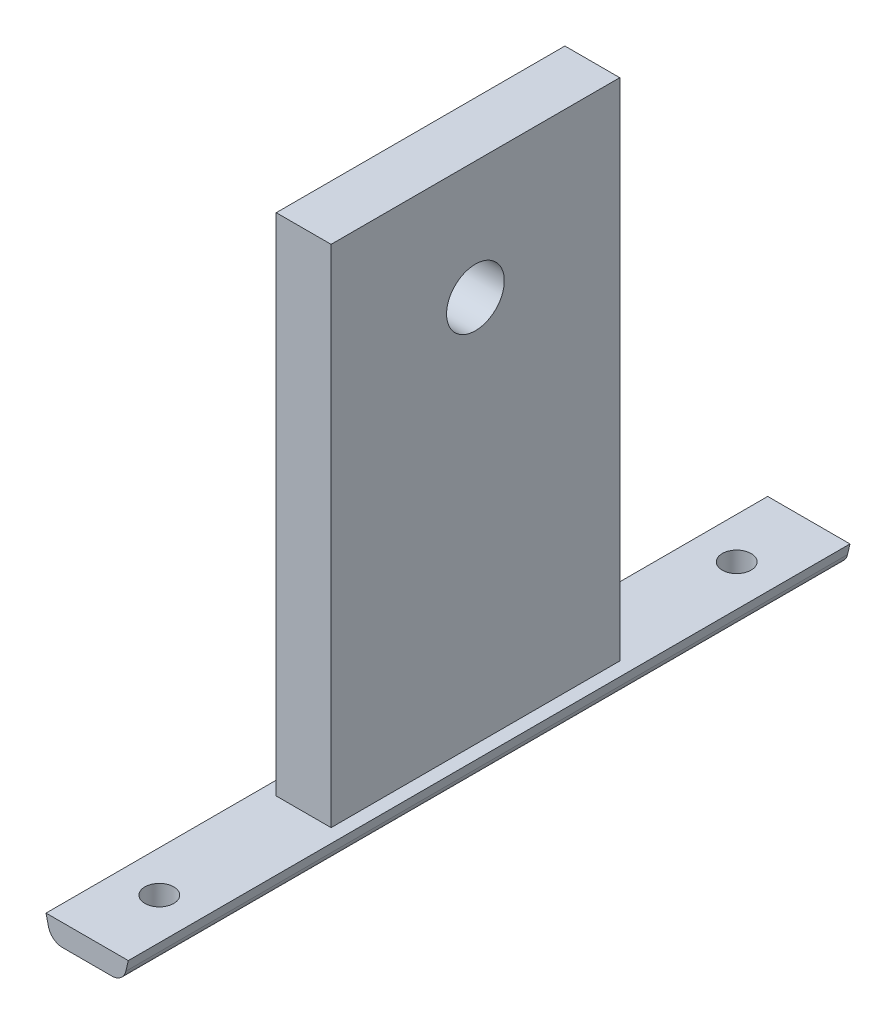
ISO-10303-21;
HEADER;
FILE_DESCRIPTION(('STEP AP214'),'2;1');
FILE_NAME('part.step','',(''),(''),'','','');
FILE_SCHEMA(('AUTOMOTIVE_DESIGN { 1 0 10303 214 1 1 1 1 }'));
ENDSEC;
DATA;
#1=APPLICATION_CONTEXT('core data for automotive mechanical design processes');
#2=APPLICATION_PROTOCOL_DEFINITION('international standard','automotive_design',2000,#1);
#3=PRODUCT_CONTEXT('',#1,'mechanical');
#4=PRODUCT('Part','Part','',(#3));
#5=PRODUCT_RELATED_PRODUCT_CATEGORY('part','',(#4));
#6=PRODUCT_DEFINITION_FORMATION('','',#4);
#7=PRODUCT_DEFINITION_CONTEXT('part definition',#1,'design');
#8=PRODUCT_DEFINITION('design','',#6,#7);
#9=PRODUCT_DEFINITION_SHAPE('','',#8);
#10=(LENGTH_UNIT() NAMED_UNIT(*) SI_UNIT(.MILLI.,.METRE.));
#11=(NAMED_UNIT(*) PLANE_ANGLE_UNIT() SI_UNIT($,.RADIAN.));
#12=(NAMED_UNIT(*) SI_UNIT($,.STERADIAN.) SOLID_ANGLE_UNIT());
#13=UNCERTAINTY_MEASURE_WITH_UNIT(LENGTH_MEASURE(1.E-05),#10,'distance_accuracy_value','');
#14=(GEOMETRIC_REPRESENTATION_CONTEXT(3) GLOBAL_UNCERTAINTY_ASSIGNED_CONTEXT((#13)) GLOBAL_UNIT_ASSIGNED_CONTEXT((#10,
#11,#12)) REPRESENTATION_CONTEXT('',''));
#15=CARTESIAN_POINT('',(0.,0.,0.));
#16=DIRECTION('',(0.,0.,1.));
#17=DIRECTION('',(1.,0.,0.));
#18=AXIS2_PLACEMENT_3D('',#15,#16,#17);
#19=CARTESIAN_POINT('',(3.8,-48.1786246589821,100.));
#20=DIRECTION('',(-1.,0.,0.));
#21=DIRECTION('',(0.,0.,1.));
#22=AXIS2_PLACEMENT_3D('',#19,#20,#21);
#23=PLANE('',#22);
#24=DIRECTION('',(0.,0.,-1.));
#25=VECTOR('',#24,1.);
#26=CARTESIAN_POINT('',(3.8,21.821375341018,100.));
#27=LINE('',#26,#25);
#28=CARTESIAN_POINT('',(3.8,21.821375341018,70.));
#29=VERTEX_POINT('',#28);
#30=CARTESIAN_POINT('',(3.8,21.821375341018,30.));
#31=VERTEX_POINT('',#30);
#32=EDGE_CURVE('E45',#29,#31,#27,.T.);
#33=ORIENTED_EDGE('',*,*,#32,.F.);
#34=DIRECTION('',(0.,-1.,0.));
#35=VECTOR('',#34,1.);
#36=CARTESIAN_POINT('',(3.8,21.821375341018,70.));
#37=LINE('',#36,#35);
#38=CARTESIAN_POINT('',(3.8,-48.1786246589821,70.));
#39=VERTEX_POINT('',#38);
#40=EDGE_CURVE('E190',#29,#39,#37,.T.);
#41=ORIENTED_EDGE('',*,*,#40,.T.);
#42=DIRECTION('',(0.,0.,-1.));
#43=VECTOR('',#42,1.);
#44=CARTESIAN_POINT('',(3.8,-48.1786246589821,100.));
#45=LINE('',#44,#43);
#46=CARTESIAN_POINT('',(3.8,-48.1786246589821,30.));
#47=VERTEX_POINT('',#46);
#48=EDGE_CURVE('E12',#39,#47,#45,.T.);
#49=ORIENTED_EDGE('',*,*,#48,.T.);
#50=DIRECTION('',(0.,1.,0.));
#51=VECTOR('',#50,1.);
#52=CARTESIAN_POINT('',(3.8,-48.1786246589821,30.));
#53=LINE('',#52,#51);
#54=EDGE_CURVE('E213',#47,#31,#53,.T.);
#55=ORIENTED_EDGE('',*,*,#54,.T.);
#56=EDGE_LOOP('',(#33,#41,#49,#55));
#57=FACE_BOUND('',#56,.T.);
#58=CARTESIAN_POINT('',(3.8,5.45168836956956,50.));
#59=DIRECTION('',(1.,0.,0.));
#60=DIRECTION('',(0.,0.,-1.));
#61=AXIS2_PLACEMENT_3D('',#58,#59,#60);
#62=CIRCLE('',#61,4.);
#63=CARTESIAN_POINT('',(3.8,5.45168836956956,54.));
#64=VERTEX_POINT('',#63);
#65=EDGE_CURVE('E177',#64,#64,#62,.T.);
#66=ORIENTED_EDGE('',*,*,#65,.F.);
#67=EDGE_LOOP('',(#66));
#68=FACE_BOUND('',#67,.T.);
#69=ADVANCED_FACE('F36',(#57,#68),#23,.F.);
#70=CARTESIAN_POINT('',(-3.8,-48.1786246589821,100.));
#71=DIRECTION('',(1.,0.,0.));
#72=DIRECTION('',(0.,0.,-1.));
#73=AXIS2_PLACEMENT_3D('',#70,#71,#72);
#74=PLANE('',#73);
#75=DIRECTION('',(0.,0.,-1.));
#76=VECTOR('',#75,1.);
#77=CARTESIAN_POINT('',(-3.8,-48.1786246589821,100.));
#78=LINE('',#77,#76);
#79=CARTESIAN_POINT('',(-3.8,-48.1786246589821,70.));
#80=VERTEX_POINT('',#79);
#81=CARTESIAN_POINT('',(-3.8,-48.1786246589821,30.));
#82=VERTEX_POINT('',#81);
#83=EDGE_CURVE('E146',#80,#82,#78,.T.);
#84=ORIENTED_EDGE('',*,*,#83,.F.);
#85=DIRECTION('',(0.,1.,0.));
#86=VECTOR('',#85,1.);
#87=CARTESIAN_POINT('',(-3.8,-48.1786246589821,70.));
#88=LINE('',#87,#86);
#89=CARTESIAN_POINT('',(-3.8,21.821375341018,70.));
#90=VERTEX_POINT('',#89);
#91=EDGE_CURVE('E193',#80,#90,#88,.T.);
#92=ORIENTED_EDGE('',*,*,#91,.T.);
#93=DIRECTION('',(0.,0.,-1.));
#94=VECTOR('',#93,1.);
#95=CARTESIAN_POINT('',(-3.8,21.821375341018,100.));
#96=LINE('',#95,#94);
#97=CARTESIAN_POINT('',(-3.8,21.821375341018,30.));
#98=VERTEX_POINT('',#97);
#99=EDGE_CURVE('E154',#90,#98,#96,.T.);
#100=ORIENTED_EDGE('',*,*,#99,.T.);
#101=DIRECTION('',(0.,-1.,0.));
#102=VECTOR('',#101,1.);
#103=CARTESIAN_POINT('',(-3.8,-48.1786246589821,30.));
#104=LINE('',#103,#102);
#105=EDGE_CURVE('E196',#98,#82,#104,.T.);
#106=ORIENTED_EDGE('',*,*,#105,.T.);
#107=EDGE_LOOP('',(#84,#92,#100,#106));
#108=FACE_BOUND('',#107,.T.);
#109=CARTESIAN_POINT('',(-3.8,5.45168836956956,50.));
#110=DIRECTION('',(1.,0.,0.));
#111=DIRECTION('',(0.,0.,-1.));
#112=AXIS2_PLACEMENT_3D('',#109,#110,#111);
#113=CIRCLE('',#112,4.);
#114=CARTESIAN_POINT('',(-3.8,5.45168836956956,54.));
#115=VERTEX_POINT('',#114);
#116=EDGE_CURVE('E39',#115,#115,#113,.F.);
#117=ORIENTED_EDGE('',*,*,#116,.F.);
#118=EDGE_LOOP('',(#117));
#119=FACE_BOUND('',#118,.T.);
#120=ADVANCED_FACE('F232',(#108,#119),#74,.F.);
#121=CARTESIAN_POINT('',(-3.8,-48.1786246589821,100.));
#122=DIRECTION('',(0.,-1.,0.));
#123=DIRECTION('',(0.,0.,-1.));
#124=AXIS2_PLACEMENT_3D('',#121,#122,#123);
#125=PLANE('',#124);
#126=CARTESIAN_POINT('',(0.,-48.1786246589821,10.));
#127=DIRECTION('',(0.,-1.,0.));
#128=DIRECTION('',(0.,0.,-1.));
#129=AXIS2_PLACEMENT_3D('',#126,#127,#128);
#130=CIRCLE('',#129,2.);
#131=CARTESIAN_POINT('',(0.,-48.1786246589821,8.));
#132=VERTEX_POINT('',#131);
#133=EDGE_CURVE('E168',#132,#132,#130,.F.);
#134=ORIENTED_EDGE('',*,*,#133,.F.);
#135=EDGE_LOOP('',(#134));
#136=FACE_BOUND('',#135,.T.);
#137=ORIENTED_EDGE('',*,*,#48,.F.);
#138=DIRECTION('',(-1.,0.,0.));
#139=VECTOR('',#138,1.);
#140=CARTESIAN_POINT('',(3.8,-48.1786246589821,70.));
#141=LINE('',#140,#139);
#142=EDGE_CURVE('E187',#39,#80,#141,.T.);
#143=ORIENTED_EDGE('',*,*,#142,.T.);
#144=ORIENTED_EDGE('',*,*,#83,.T.);
#145=DIRECTION('',(1.,0.,0.));
#146=VECTOR('',#145,1.);
#147=CARTESIAN_POINT('',(-3.8,-48.1786246589821,30.));
#148=LINE('',#147,#146);
#149=EDGE_CURVE('E210',#82,#47,#148,.T.);
#150=ORIENTED_EDGE('',*,*,#149,.T.);
#151=EDGE_LOOP('',(#137,#143,#144,#150));
#152=FACE_BOUND('',#151,.T.);
#153=DIRECTION('',(-1.,0.,0.));
#154=VECTOR('',#153,1.);
#155=CARTESIAN_POINT('',(-3.8,-48.1786246589821,0.));
#156=LINE('',#155,#154);
#157=CARTESIAN_POINT('',(5.70000000000001,-48.1786246589821,0.));
#158=VERTEX_POINT('',#157);
#159=CARTESIAN_POINT('',(-5.69999999999999,-48.1786246589821,0.));
#160=VERTEX_POINT('',#159);
#161=EDGE_CURVE('E85',#158,#160,#156,.T.);
#162=ORIENTED_EDGE('',*,*,#161,.T.);
#163=DIRECTION('',(0.,0.,-1.));
#164=VECTOR('',#163,1.);
#165=CARTESIAN_POINT('',(-5.69999999999999,-48.1786246589821,100.));
#166=LINE('',#165,#164);
#167=CARTESIAN_POINT('',(-5.69999999999999,-48.1786246589821,100.));
#168=VERTEX_POINT('',#167);
#169=EDGE_CURVE('E143',#168,#160,#166,.T.);
#170=ORIENTED_EDGE('',*,*,#169,.F.);
#171=DIRECTION('',(-1.,0.,0.));
#172=VECTOR('',#171,1.);
#173=CARTESIAN_POINT('',(3.8,-48.1786246589821,100.));
#174=LINE('',#173,#172);
#175=CARTESIAN_POINT('',(5.70000000000001,-48.1786246589821,100.));
#176=VERTEX_POINT('',#175);
#177=EDGE_CURVE('E91',#176,#168,#174,.T.);
#178=ORIENTED_EDGE('',*,*,#177,.F.);
#179=DIRECTION('',(0.,0.,-1.));
#180=VECTOR('',#179,1.);
#181=CARTESIAN_POINT('',(5.70000000000001,-48.1786246589821,100.));
#182=LINE('',#181,#180);
#183=EDGE_CURVE('E122',#176,#158,#182,.T.);
#184=ORIENTED_EDGE('',*,*,#183,.T.);
#185=EDGE_LOOP('',(#162,#170,#178,#184));
#186=FACE_BOUND('',#185,.T.);
#187=CARTESIAN_POINT('',(0.,-48.1786246589821,90.));
#188=DIRECTION('',(0.,-1.,0.));
#189=DIRECTION('',(0.,0.,-1.));
#190=AXIS2_PLACEMENT_3D('',#187,#188,#189);
#191=CIRCLE('',#190,2.);
#192=CARTESIAN_POINT('',(0.,-48.1786246589821,88.));
#193=VERTEX_POINT('',#192);
#194=EDGE_CURVE('E169',#193,#193,#191,.F.);
#195=ORIENTED_EDGE('',*,*,#194,.F.);
#196=EDGE_LOOP('',(#195));
#197=FACE_BOUND('',#196,.T.);
#198=ADVANCED_FACE('F229',(#136,#152,#186,#197),#125,.F.);
#199=CARTESIAN_POINT('',(-3.41294375990008,-51.1786246589821,100.));
#200=DIRECTION('',(0.,1.,0.));
#201=DIRECTION('',(0.,0.,1.));
#202=AXIS2_PLACEMENT_3D('',#199,#200,#201);
#203=PLANE('',#202);
#204=CARTESIAN_POINT('',(0.,-51.1786246589821,10.));
#205=DIRECTION('',(0.,1.,0.));
#206=DIRECTION('',(0.,0.,1.));
#207=AXIS2_PLACEMENT_3D('',#204,#205,#206);
#208=CIRCLE('',#207,2.);
#209=CARTESIAN_POINT('',(0.,-51.1786246589821,12.));
#210=VERTEX_POINT('',#209);
#211=EDGE_CURVE('E166',#210,#210,#208,.F.);
#212=ORIENTED_EDGE('',*,*,#211,.F.);
#213=EDGE_LOOP('',(#212));
#214=FACE_BOUND('',#213,.T.);
#215=DIRECTION('',(1.,0.,0.));
#216=VECTOR('',#215,1.);
#217=CARTESIAN_POINT('',(-3.41294375990008,-51.1786246589821,0.));
#218=LINE('',#217,#216);
#219=CARTESIAN_POINT('',(-3.41294375990008,-51.1786246589821,0.));
#220=VERTEX_POINT('',#219);
#221=CARTESIAN_POINT('',(3.4129437599001,-51.1786246589821,0.));
#222=VERTEX_POINT('',#221);
#223=EDGE_CURVE('E116',#220,#222,#218,.T.);
#224=ORIENTED_EDGE('',*,*,#223,.T.);
#225=DIRECTION('',(0.,0.,-1.));
#226=VECTOR('',#225,1.);
#227=CARTESIAN_POINT('',(3.4129437599001,-51.1786246589821,100.));
#228=LINE('',#227,#226);
#229=CARTESIAN_POINT('',(3.4129437599001,-51.1786246589821,100.));
#230=VERTEX_POINT('',#229);
#231=EDGE_CURVE('E112',#230,#222,#228,.T.);
#232=ORIENTED_EDGE('',*,*,#231,.F.);
#233=DIRECTION('',(1.,0.,0.));
#234=VECTOR('',#233,1.);
#235=CARTESIAN_POINT('',(-3.41294375990008,-51.1786246589821,100.));
#236=LINE('',#235,#234);
#237=CARTESIAN_POINT('',(-3.41294375990008,-51.1786246589821,100.));
#238=VERTEX_POINT('',#237);
#239=EDGE_CURVE('E101',#238,#230,#236,.T.);
#240=ORIENTED_EDGE('',*,*,#239,.F.);
#241=DIRECTION('',(0.,0.,-1.));
#242=VECTOR('',#241,1.);
#243=CARTESIAN_POINT('',(-3.41294375990008,-51.1786246589821,100.));
#244=LINE('',#243,#242);
#245=EDGE_CURVE('E117',#238,#220,#244,.T.);
#246=ORIENTED_EDGE('',*,*,#245,.T.);
#247=EDGE_LOOP('',(#224,#232,#240,#246));
#248=FACE_BOUND('',#247,.T.);
#249=CARTESIAN_POINT('',(0.,-51.1786246589821,90.));
#250=DIRECTION('',(0.,1.,0.));
#251=DIRECTION('',(0.,0.,1.));
#252=AXIS2_PLACEMENT_3D('',#249,#250,#251);
#253=CIRCLE('',#252,2.);
#254=CARTESIAN_POINT('',(0.,-51.1786246589821,92.));
#255=VERTEX_POINT('',#254);
#256=EDGE_CURVE('E170',#255,#255,#253,.F.);
#257=ORIENTED_EDGE('',*,*,#256,.F.);
#258=EDGE_LOOP('',(#257));
#259=FACE_BOUND('',#258,.T.);
#260=ADVANCED_FACE('F113',(#214,#248,#259),#203,.F.);
#261=CARTESIAN_POINT('',(3.8,21.821375341018,100.));
#262=DIRECTION('',(0.,-1.,0.));
#263=DIRECTION('',(0.,0.,-1.));
#264=AXIS2_PLACEMENT_3D('',#261,#262,#263);
#265=PLANE('',#264);
#266=ORIENTED_EDGE('',*,*,#99,.F.);
#267=DIRECTION('',(1.,0.,0.));
#268=VECTOR('',#267,1.);
#269=CARTESIAN_POINT('',(-3.8,21.821375341018,70.));
#270=LINE('',#269,#268);
#271=EDGE_CURVE('E197',#90,#29,#270,.T.);
#272=ORIENTED_EDGE('',*,*,#271,.T.);
#273=ORIENTED_EDGE('',*,*,#32,.T.);
#274=DIRECTION('',(-1.,0.,0.));
#275=VECTOR('',#274,1.);
#276=CARTESIAN_POINT('',(-3.8,21.821375341018,30.));
#277=LINE('',#276,#275);
#278=EDGE_CURVE('E128',#31,#98,#277,.T.);
#279=ORIENTED_EDGE('',*,*,#278,.T.);
#280=EDGE_LOOP('',(#266,#272,#273,#279));
#281=FACE_BOUND('',#280,.T.);
#282=ADVANCED_FACE('F270',(#281),#265,.F.);
#283=CARTESIAN_POINT('',(-5.36062617938366,-49.6330838901949,100.));
#284=DIRECTION('',(0.973841209741793,0.227229615606418,0.));
#285=DIRECTION('',(-0.227229615606418,0.973841209741793,0.));
#286=AXIS2_PLACEMENT_3D('',#283,#284,#285);
#287=PLANE('',#286);
#288=DIRECTION('',(0.227229615606418,-0.973841209741793,0.));
#289=VECTOR('',#288,1.);
#290=CARTESIAN_POINT('',(-5.36062617938366,-49.6330838901949,0.));
#291=LINE('',#290,#289);
#292=CARTESIAN_POINT('',(-5.36062617938366,-49.6330838901949,0.));
#293=VERTEX_POINT('',#292);
#294=EDGE_CURVE('E127',#160,#293,#291,.T.);
#295=ORIENTED_EDGE('',*,*,#294,.T.);
#296=DIRECTION('',(0.,0.,-1.));
#297=VECTOR('',#296,1.);
#298=CARTESIAN_POINT('',(-5.36062617938366,-49.6330838901949,100.));
#299=LINE('',#298,#297);
#300=CARTESIAN_POINT('',(-5.36062617938366,-49.6330838901949,100.));
#301=VERTEX_POINT('',#300);
#302=EDGE_CURVE('E140',#301,#293,#299,.T.);
#303=ORIENTED_EDGE('',*,*,#302,.F.);
#304=DIRECTION('',(0.227229615606418,-0.973841209741793,0.));
#305=VECTOR('',#304,1.);
#306=CARTESIAN_POINT('',(-5.36062617938366,-49.6330838901949,100.));
#307=LINE('',#306,#305);
#308=EDGE_CURVE('E163',#168,#301,#307,.T.);
#309=ORIENTED_EDGE('',*,*,#308,.F.);
#310=ORIENTED_EDGE('',*,*,#169,.T.);
#311=EDGE_LOOP('',(#295,#303,#309,#310));
#312=FACE_BOUND('',#311,.T.);
#313=ADVANCED_FACE('F221',(#312),#287,.F.);
#314=CARTESIAN_POINT('',(-3.41294375990008,-49.1786246589821,100.));
#315=DIRECTION('',(0.,0.,-1.));
#316=DIRECTION('',(-1.,0.,0.));
#317=AXIS2_PLACEMENT_3D('',#314,#315,#316);
#318=CYLINDRICAL_SURFACE('',#317,2.);
#319=CARTESIAN_POINT('',(-3.41294375990008,-49.1786246589821,0.));
#320=DIRECTION('',(0.,0.,1.));
#321=DIRECTION('',(1.,0.,0.));
#322=AXIS2_PLACEMENT_3D('',#319,#320,#321);
#323=CIRCLE('',#322,2.);
#324=EDGE_CURVE('E130',#293,#220,#323,.T.);
#325=ORIENTED_EDGE('',*,*,#324,.T.);
#326=ORIENTED_EDGE('',*,*,#245,.F.);
#327=CARTESIAN_POINT('',(-3.41294375990008,-49.1786246589821,100.));
#328=DIRECTION('',(0.,0.,1.));
#329=DIRECTION('',(1.,0.,0.));
#330=AXIS2_PLACEMENT_3D('',#327,#328,#329);
#331=CIRCLE('',#330,2.);
#332=EDGE_CURVE('E107',#301,#238,#331,.T.);
#333=ORIENTED_EDGE('',*,*,#332,.F.);
#334=ORIENTED_EDGE('',*,*,#302,.T.);
#335=EDGE_LOOP('',(#325,#326,#333,#334));
#336=FACE_BOUND('',#335,.T.);
#337=ADVANCED_FACE('F224',(#336),#318,.T.);
#338=CARTESIAN_POINT('',(3.4129437599001,-49.1786246589821,100.));
#339=DIRECTION('',(0.,0.,-1.));
#340=DIRECTION('',(-1.,0.,0.));
#341=AXIS2_PLACEMENT_3D('',#338,#339,#340);
#342=CYLINDRICAL_SURFACE('',#341,2.);
#343=CARTESIAN_POINT('',(3.4129437599001,-49.1786246589821,0.));
#344=DIRECTION('',(0.,0.,1.));
#345=DIRECTION('',(1.,0.,0.));
#346=AXIS2_PLACEMENT_3D('',#343,#344,#345);
#347=CIRCLE('',#346,2.);
#348=CARTESIAN_POINT('',(5.36062617938369,-49.6330838901949,0.));
#349=VERTEX_POINT('',#348);
#350=EDGE_CURVE('E78',#222,#349,#347,.T.);
#351=ORIENTED_EDGE('',*,*,#350,.T.);
#352=DIRECTION('',(0.,0.,-1.));
#353=VECTOR('',#352,1.);
#354=CARTESIAN_POINT('',(5.36062617938369,-49.6330838901949,100.));
#355=LINE('',#354,#353);
#356=CARTESIAN_POINT('',(5.36062617938369,-49.6330838901949,100.));
#357=VERTEX_POINT('',#356);
#358=EDGE_CURVE('E118',#357,#349,#355,.T.);
#359=ORIENTED_EDGE('',*,*,#358,.F.);
#360=CARTESIAN_POINT('',(3.4129437599001,-49.1786246589821,100.));
#361=DIRECTION('',(0.,0.,1.));
#362=DIRECTION('',(1.,0.,0.));
#363=AXIS2_PLACEMENT_3D('',#360,#361,#362);
#364=CIRCLE('',#363,2.);
#365=EDGE_CURVE('E105',#230,#357,#364,.T.);
#366=ORIENTED_EDGE('',*,*,#365,.F.);
#367=ORIENTED_EDGE('',*,*,#231,.T.);
#368=EDGE_LOOP('',(#351,#359,#366,#367));
#369=FACE_BOUND('',#368,.T.);
#370=ADVANCED_FACE('F120',(#369),#342,.T.);
#371=CARTESIAN_POINT('',(5.70000000000001,-48.1786246589821,100.));
#372=DIRECTION('',(-0.973841209741795,0.227229615606412,0.));
#373=DIRECTION('',(-0.227229615606412,-0.973841209741795,0.));
#374=AXIS2_PLACEMENT_3D('',#371,#372,#373);
#375=PLANE('',#374);
#376=DIRECTION('',(0.227229615606412,0.973841209741795,0.));
#377=VECTOR('',#376,1.);
#378=CARTESIAN_POINT('',(5.70000000000001,-48.1786246589821,0.));
#379=LINE('',#378,#377);
#380=EDGE_CURVE('E134',#349,#158,#379,.T.);
#381=ORIENTED_EDGE('',*,*,#380,.T.);
#382=ORIENTED_EDGE('',*,*,#183,.F.);
#383=DIRECTION('',(0.227229615606412,0.973841209741795,0.));
#384=VECTOR('',#383,1.);
#385=CARTESIAN_POINT('',(5.70000000000001,-48.1786246589821,100.));
#386=LINE('',#385,#384);
#387=EDGE_CURVE('E54',#357,#176,#386,.T.);
#388=ORIENTED_EDGE('',*,*,#387,.F.);
#389=ORIENTED_EDGE('',*,*,#358,.T.);
#390=EDGE_LOOP('',(#381,#382,#388,#389));
#391=FACE_BOUND('',#390,.T.);
#392=ADVANCED_FACE('F227',(#391),#375,.F.);
#393=CARTESIAN_POINT('',(3.4129437599001,-49.1786246589821,100.));
#394=DIRECTION('',(0.,0.,1.));
#395=DIRECTION('',(1.,0.,0.));
#396=AXIS2_PLACEMENT_3D('',#393,#394,#395);
#397=PLANE('',#396);
#398=ORIENTED_EDGE('',*,*,#177,.T.);
#399=ORIENTED_EDGE('',*,*,#308,.T.);
#400=ORIENTED_EDGE('',*,*,#332,.T.);
#401=ORIENTED_EDGE('',*,*,#239,.T.);
#402=ORIENTED_EDGE('',*,*,#365,.T.);
#403=ORIENTED_EDGE('',*,*,#387,.T.);
#404=EDGE_LOOP('',(#398,#399,#400,#401,#402,#403));
#405=FACE_BOUND('',#404,.T.);
#406=ADVANCED_FACE('F103',(#405),#397,.T.);
#407=CARTESIAN_POINT('',(3.4129437599001,-49.1786246589821,0.));
#408=DIRECTION('',(0.,0.,1.));
#409=DIRECTION('',(1.,0.,0.));
#410=AXIS2_PLACEMENT_3D('',#407,#408,#409);
#411=PLANE('',#410);
#412=ORIENTED_EDGE('',*,*,#161,.F.);
#413=ORIENTED_EDGE('',*,*,#380,.F.);
#414=ORIENTED_EDGE('',*,*,#350,.F.);
#415=ORIENTED_EDGE('',*,*,#223,.F.);
#416=ORIENTED_EDGE('',*,*,#324,.F.);
#417=ORIENTED_EDGE('',*,*,#294,.F.);
#418=EDGE_LOOP('',(#412,#413,#414,#415,#416,#417));
#419=FACE_BOUND('',#418,.T.);
#420=ADVANCED_FACE('F225',(#419),#411,.F.);
#421=CARTESIAN_POINT('',(0.,0.,30.));
#422=DIRECTION('',(0.,0.,-1.));
#423=DIRECTION('',(-1.,0.,0.));
#424=AXIS2_PLACEMENT_3D('',#421,#422,#423);
#425=PLANE('',#424);
#426=ORIENTED_EDGE('',*,*,#105,.F.);
#427=ORIENTED_EDGE('',*,*,#278,.F.);
#428=ORIENTED_EDGE('',*,*,#54,.F.);
#429=ORIENTED_EDGE('',*,*,#149,.F.);
#430=EDGE_LOOP('',(#426,#427,#428,#429));
#431=FACE_BOUND('',#430,.T.);
#432=ADVANCED_FACE('F275',(#431),#425,.T.);
#433=CARTESIAN_POINT('',(0.,0.,70.));
#434=DIRECTION('',(0.,0.,-1.));
#435=DIRECTION('',(-1.,0.,0.));
#436=AXIS2_PLACEMENT_3D('',#433,#434,#435);
#437=PLANE('',#436);
#438=ORIENTED_EDGE('',*,*,#142,.F.);
#439=ORIENTED_EDGE('',*,*,#40,.F.);
#440=ORIENTED_EDGE('',*,*,#271,.F.);
#441=ORIENTED_EDGE('',*,*,#91,.F.);
#442=EDGE_LOOP('',(#438,#439,#440,#441));
#443=FACE_BOUND('',#442,.T.);
#444=ADVANCED_FACE('F247',(#443),#437,.F.);
#445=CARTESIAN_POINT('',(0.,-48.1786246589821,10.));
#446=DIRECTION('',(0.,-1.,0.));
#447=DIRECTION('',(0.,0.,-1.));
#448=AXIS2_PLACEMENT_3D('',#445,#446,#447);
#449=CYLINDRICAL_SURFACE('',#448,2.);
#450=ORIENTED_EDGE('',*,*,#211,.T.);
#451=EDGE_LOOP('',(#450));
#452=FACE_BOUND('',#451,.T.);
#453=ORIENTED_EDGE('',*,*,#133,.T.);
#454=EDGE_LOOP('',(#453));
#455=FACE_BOUND('',#454,.T.);
#456=ADVANCED_FACE('F240',(#452,#455),#449,.F.);
#457=CARTESIAN_POINT('',(0.,-48.1786246589821,90.));
#458=DIRECTION('',(0.,-1.,0.));
#459=DIRECTION('',(0.,0.,-1.));
#460=AXIS2_PLACEMENT_3D('',#457,#458,#459);
#461=CYLINDRICAL_SURFACE('',#460,2.);
#462=ORIENTED_EDGE('',*,*,#256,.T.);
#463=EDGE_LOOP('',(#462));
#464=FACE_BOUND('',#463,.T.);
#465=ORIENTED_EDGE('',*,*,#194,.T.);
#466=EDGE_LOOP('',(#465));
#467=FACE_BOUND('',#466,.T.);
#468=ADVANCED_FACE('F237',(#464,#467),#461,.F.);
#469=CARTESIAN_POINT('',(3.8,5.45168836956956,50.));
#470=DIRECTION('',(-1.,0.,0.));
#471=DIRECTION('',(0.,0.,1.));
#472=AXIS2_PLACEMENT_3D('',#469,#470,#471);
#473=CYLINDRICAL_SURFACE('',#472,4.);
#474=CARTESIAN_POINT('',(3.8,5.45168836956956,54.));
#475=CARTESIAN_POINT('',(3.72083333333333,5.45168836956956,54.));
#476=CARTESIAN_POINT('',(3.64166666666667,5.45168836956956,54.));
#477=CARTESIAN_POINT('',(3.48333333333333,5.45168836956956,54.));
#478=CARTESIAN_POINT('',(3.40416666666667,5.45168836956956,54.));
#479=CARTESIAN_POINT('',(3.24583333333333,5.45168836956956,54.));
#480=CARTESIAN_POINT('',(3.16666666666667,5.45168836956956,54.));
#481=CARTESIAN_POINT('',(3.00833333333333,5.45168836956956,54.));
#482=CARTESIAN_POINT('',(2.92916666666667,5.45168836956956,54.));
#483=CARTESIAN_POINT('',(2.77083333333333,5.45168836956956,54.));
#484=CARTESIAN_POINT('',(2.69166666666667,5.45168836956956,54.));
#485=CARTESIAN_POINT('',(2.53333333333333,5.45168836956956,54.));
#486=CARTESIAN_POINT('',(2.45416666666667,5.45168836956956,54.));
#487=CARTESIAN_POINT('',(2.29583333333333,5.45168836956956,54.));
#488=CARTESIAN_POINT('',(2.21666666666667,5.45168836956956,54.));
#489=CARTESIAN_POINT('',(2.05833333333333,5.45168836956956,54.));
#490=CARTESIAN_POINT('',(1.97916666666667,5.45168836956956,54.));
#491=CARTESIAN_POINT('',(1.82083333333333,5.45168836956956,54.));
#492=CARTESIAN_POINT('',(1.74166666666667,5.45168836956956,54.));
#493=CARTESIAN_POINT('',(1.58333333333333,5.45168836956956,54.));
#494=CARTESIAN_POINT('',(1.50416666666667,5.45168836956956,54.));
#495=CARTESIAN_POINT('',(1.34583333333333,5.45168836956956,54.));
#496=CARTESIAN_POINT('',(1.26666666666667,5.45168836956956,54.));
#497=CARTESIAN_POINT('',(1.10833333333333,5.45168836956956,54.));
#498=CARTESIAN_POINT('',(1.02916666666667,5.45168836956956,54.));
#499=CARTESIAN_POINT('',(0.870833333333334,5.45168836956956,54.));
#500=CARTESIAN_POINT('',(0.791666666666668,5.45168836956956,54.));
#501=CARTESIAN_POINT('',(0.633333333333334,5.45168836956956,54.));
#502=CARTESIAN_POINT('',(0.554166666666667,5.45168836956956,54.));
#503=CARTESIAN_POINT('',(0.395833333333334,5.45168836956956,54.));
#504=CARTESIAN_POINT('',(0.316666666666667,5.45168836956956,54.));
#505=CARTESIAN_POINT('',(0.158333333333334,5.45168836956956,54.));
#506=CARTESIAN_POINT('',(0.0791666666666671,5.45168836956956,54.));
#507=CARTESIAN_POINT('',(-0.079166666666666,5.45168836956956,54.));
#508=CARTESIAN_POINT('',(-0.158333333333333,5.45168836956956,54.));
#509=CARTESIAN_POINT('',(-0.316666666666666,5.45168836956956,54.));
#510=CARTESIAN_POINT('',(-0.395833333333332,5.45168836956956,54.));
#511=CARTESIAN_POINT('',(-0.554166666666666,5.45168836956956,54.));
#512=CARTESIAN_POINT('',(-0.633333333333333,5.45168836956956,54.));
#513=CARTESIAN_POINT('',(-0.791666666666666,5.45168836956956,54.));
#514=CARTESIAN_POINT('',(-0.870833333333333,5.45168836956956,54.));
#515=CARTESIAN_POINT('',(-1.02916666666667,5.45168836956956,54.));
#516=CARTESIAN_POINT('',(-1.10833333333333,5.45168836956956,54.));
#517=CARTESIAN_POINT('',(-1.26666666666667,5.45168836956956,54.));
#518=CARTESIAN_POINT('',(-1.34583333333333,5.45168836956956,54.));
#519=CARTESIAN_POINT('',(-1.50416666666667,5.45168836956956,54.));
#520=CARTESIAN_POINT('',(-1.58333333333333,5.45168836956956,54.));
#521=CARTESIAN_POINT('',(-1.74166666666667,5.45168836956956,54.));
#522=CARTESIAN_POINT('',(-1.82083333333333,5.45168836956956,54.));
#523=CARTESIAN_POINT('',(-1.97916666666667,5.45168836956956,54.));
#524=CARTESIAN_POINT('',(-2.05833333333333,5.45168836956956,54.));
#525=CARTESIAN_POINT('',(-2.21666666666667,5.45168836956956,54.));
#526=CARTESIAN_POINT('',(-2.29583333333333,5.45168836956956,54.));
#527=CARTESIAN_POINT('',(-2.45416666666667,5.45168836956956,54.));
#528=CARTESIAN_POINT('',(-2.53333333333333,5.45168836956956,54.));
#529=CARTESIAN_POINT('',(-2.69166666666667,5.45168836956956,54.));
#530=CARTESIAN_POINT('',(-2.77083333333333,5.45168836956956,54.));
#531=CARTESIAN_POINT('',(-2.92916666666667,5.45168836956956,54.));
#532=CARTESIAN_POINT('',(-3.00833333333333,5.45168836956956,54.));
#533=CARTESIAN_POINT('',(-3.16666666666667,5.45168836956956,54.));
#534=CARTESIAN_POINT('',(-3.24583333333333,5.45168836956956,54.));
#535=CARTESIAN_POINT('',(-3.40416666666667,5.45168836956956,54.));
#536=CARTESIAN_POINT('',(-3.48333333333333,5.45168836956956,54.));
#537=CARTESIAN_POINT('',(-3.64166666666667,5.45168836956956,54.));
#538=CARTESIAN_POINT('',(-3.72083333333333,5.45168836956956,54.));
#539=CARTESIAN_POINT('',(-3.8,5.45168836956956,54.));
#540=B_SPLINE_CURVE_WITH_KNOTS('',3,(#474,#475,#476,#477,#478,#479,#480,#481,#482,#483,#484,
#485,#486,#487,#488,#489,#490,#491,#492,#493,#494,#495,#496,#497,#498,#499,#500,#501,#502,#503,
#504,#505,#506,#507,#508,#509,#510,#511,#512,#513,#514,#515,#516,#517,#518,#519,#520,#521,#522,
#523,#524,#525,#526,#527,#528,#529,#530,#531,#532,#533,#534,#535,#536,#537,#538,#539),
.UNSPECIFIED.,.F.,.F.,(4,2,2,2,2,2,2,2,2,2,2,2,2,2,2,2,2,2,2,2,2,2,2,2,2,2,2,2,2,2,2,2,4),(0.,
0.2375,0.475,0.7125,0.95,1.1875,1.425,1.6625,1.9,2.1375,2.375,2.6125,2.85,3.0875,3.325,3.5625,
3.8,4.0375,4.275,4.5125,4.75,4.9875,5.225,5.4625,5.7,5.9375,6.175,6.4125,6.65,6.8875,7.125,
7.3625,7.6),.UNSPECIFIED.);
#541=EDGE_CURVE('BSEAM239',#64,#115,#540,.T.);
#542=ORIENTED_EDGE('',*,*,#65,.T.);
#543=ORIENTED_EDGE('',*,*,#116,.T.);
#544=ORIENTED_EDGE('',*,*,#541,.T.);
#545=ORIENTED_EDGE('',*,*,#541,.F.);
#546=EDGE_LOOP('',(#542,#544,#543,#545));
#547=FACE_BOUND('',#546,.T.);
#548=ADVANCED_FACE('F239',(#547),#473,.F.);
#549=CLOSED_SHELL('',(#69,#120,#198,#260,#282,#313,#337,#370,#392,#406,#420,#432,#444,#456,#468,#548));
#550=MANIFOLD_SOLID_BREP('B2',#549);
#551=ADVANCED_BREP_SHAPE_REPRESENTATION('',(#18,#550),#14);
#552=SHAPE_DEFINITION_REPRESENTATION(#9,#551);
ENDSEC;
END-ISO-10303-21;
